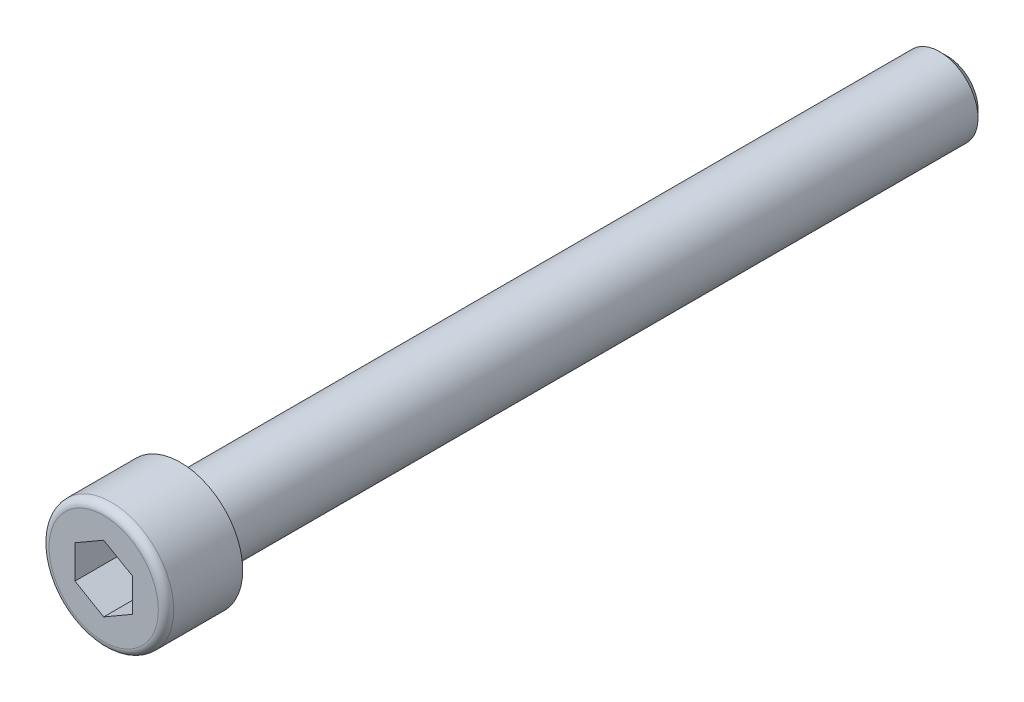
ISO-10303-21;
HEADER;
FILE_DESCRIPTION(('STEP AP214'),'2;1');
FILE_NAME('part.step','',(''),(''),'','','');
FILE_SCHEMA(('AUTOMOTIVE_DESIGN { 1 0 10303 214 1 1 1 1 }'));
ENDSEC;
DATA;
#1=APPLICATION_CONTEXT('core data for automotive mechanical design processes');
#2=APPLICATION_PROTOCOL_DEFINITION('international standard','automotive_design',2000,#1);
#3=PRODUCT_CONTEXT('',#1,'mechanical');
#4=PRODUCT('Part','Part','',(#3));
#5=PRODUCT_RELATED_PRODUCT_CATEGORY('part','',(#4));
#6=PRODUCT_DEFINITION_FORMATION('','',#4);
#7=PRODUCT_DEFINITION_CONTEXT('part definition',#1,'design');
#8=PRODUCT_DEFINITION('design','',#6,#7);
#9=PRODUCT_DEFINITION_SHAPE('','',#8);
#10=(LENGTH_UNIT() NAMED_UNIT(*) SI_UNIT(.MILLI.,.METRE.));
#11=(NAMED_UNIT(*) PLANE_ANGLE_UNIT() SI_UNIT($,.RADIAN.));
#12=(NAMED_UNIT(*) SI_UNIT($,.STERADIAN.) SOLID_ANGLE_UNIT());
#13=UNCERTAINTY_MEASURE_WITH_UNIT(LENGTH_MEASURE(1.E-05),#10,'distance_accuracy_value','');
#14=(GEOMETRIC_REPRESENTATION_CONTEXT(3) GLOBAL_UNCERTAINTY_ASSIGNED_CONTEXT((#13)) GLOBAL_UNIT_ASSIGNED_CONTEXT((#10,
#11,#12)) REPRESENTATION_CONTEXT('',''));
#15=CARTESIAN_POINT('',(0.,0.,0.));
#16=DIRECTION('',(0.,0.,1.));
#17=DIRECTION('',(1.,0.,0.));
#18=AXIS2_PLACEMENT_3D('',#15,#16,#17);
#19=CARTESIAN_POINT('',(3.20000000000001,0.,-80.));
#20=DIRECTION('',(0.,0.,-1.));
#21=DIRECTION('',(-1.,0.,0.));
#22=AXIS2_PLACEMENT_3D('',#19,#20,#21);
#23=PLANE('',#22);
#24=CARTESIAN_POINT('',(0.,0.,-80.));
#25=DIRECTION('',(0.,0.,1.));
#26=DIRECTION('',(1.,0.,0.));
#27=AXIS2_PLACEMENT_3D('',#24,#25,#26);
#28=CIRCLE('',#27,3.20000000000001);
#29=CARTESIAN_POINT('',(3.20000000000001,0.,-80.));
#30=VERTEX_POINT('',#29);
#31=EDGE_CURVE('E141',#30,#30,#28,.T.);
#32=ORIENTED_EDGE('',*,*,#31,.F.);
#33=EDGE_LOOP('',(#32));
#34=FACE_BOUND('',#33,.T.);
#35=ADVANCED_FACE('F40',(#34),#23,.T.);
#36=CARTESIAN_POINT('',(0.,0.,8.));
#37=DIRECTION('',(0.,0.,1.));
#38=DIRECTION('',(1.,0.,0.));
#39=AXIS2_PLACEMENT_3D('',#36,#37,#38);
#40=PLANE('',#39);
#41=DIRECTION('',(0.866025403784439,0.5,0.));
#42=VECTOR('',#41,1.);
#43=CARTESIAN_POINT('',(0.,-3.46410161513776,8.));
#44=LINE('',#43,#42);
#45=CARTESIAN_POINT('',(0.,-3.46410161513776,8.));
#46=VERTEX_POINT('',#45);
#47=CARTESIAN_POINT('',(3.,-1.73205080756888,8.));
#48=VERTEX_POINT('',#47);
#49=EDGE_CURVE('E54',#46,#48,#44,.T.);
#50=ORIENTED_EDGE('',*,*,#49,.F.);
#51=DIRECTION('',(0.866025403784438,-0.5,0.));
#52=VECTOR('',#51,1.);
#53=CARTESIAN_POINT('',(-3.,-1.73205080756888,8.));
#54=LINE('',#53,#52);
#55=CARTESIAN_POINT('',(-3.,-1.73205080756888,8.));
#56=VERTEX_POINT('',#55);
#57=EDGE_CURVE('E137',#56,#46,#54,.T.);
#58=ORIENTED_EDGE('',*,*,#57,.F.);
#59=DIRECTION('',(0.,-1.,0.));
#60=VECTOR('',#59,1.);
#61=CARTESIAN_POINT('',(-3.,1.73205080756888,8.));
#62=LINE('',#61,#60);
#63=CARTESIAN_POINT('',(-3.,1.73205080756888,8.));
#64=VERTEX_POINT('',#63);
#65=EDGE_CURVE('E135',#64,#56,#62,.T.);
#66=ORIENTED_EDGE('',*,*,#65,.F.);
#67=DIRECTION('',(-0.866025403784439,-0.5,0.));
#68=VECTOR('',#67,1.);
#69=CARTESIAN_POINT('',(0.,3.46410161513776,8.));
#70=LINE('',#69,#68);
#71=CARTESIAN_POINT('',(0.,3.46410161513776,8.));
#72=VERTEX_POINT('',#71);
#73=EDGE_CURVE('E102',#72,#64,#70,.T.);
#74=ORIENTED_EDGE('',*,*,#73,.F.);
#75=DIRECTION('',(-0.866025403784439,0.5,0.));
#76=VECTOR('',#75,1.);
#77=CARTESIAN_POINT('',(3.,1.73205080756888,8.));
#78=LINE('',#77,#76);
#79=CARTESIAN_POINT('',(3.,1.73205080756888,8.));
#80=VERTEX_POINT('',#79);
#81=EDGE_CURVE('E131',#80,#72,#78,.T.);
#82=ORIENTED_EDGE('',*,*,#81,.F.);
#83=DIRECTION('',(0.,1.,0.));
#84=VECTOR('',#83,1.);
#85=CARTESIAN_POINT('',(3.,-1.73205080756888,8.));
#86=LINE('',#85,#84);
#87=EDGE_CURVE('E128',#48,#80,#86,.T.);
#88=ORIENTED_EDGE('',*,*,#87,.F.);
#89=EDGE_LOOP('',(#50,#58,#66,#74,#82,#88));
#90=FACE_BOUND('',#89,.T.);
#91=CARTESIAN_POINT('',(0.,0.,8.));
#92=DIRECTION('',(0.,0.,1.));
#93=DIRECTION('',(1.,0.,0.));
#94=AXIS2_PLACEMENT_3D('',#91,#92,#93);
#95=CIRCLE('',#94,5.7);
#96=CARTESIAN_POINT('',(5.7,0.,8.));
#97=VERTEX_POINT('',#96);
#98=EDGE_CURVE('E11',#97,#97,#95,.T.);
#99=ORIENTED_EDGE('',*,*,#98,.T.);
#100=EDGE_LOOP('',(#99));
#101=FACE_BOUND('',#100,.T.);
#102=ADVANCED_FACE('F175',(#90,#101),#40,.T.);
#103=CARTESIAN_POINT('',(0.,0.,7.2));
#104=DIRECTION('',(0.,0.,1.));
#105=DIRECTION('',(1.,0.,0.));
#106=AXIS2_PLACEMENT_3D('',#103,#104,#105);
#107=TOROIDAL_SURFACE('',#106,5.7,0.8);
#108=CARTESIAN_POINT('',(0.,0.,7.2));
#109=DIRECTION('',(0.,0.,1.));
#110=DIRECTION('',(1.,0.,0.));
#111=AXIS2_PLACEMENT_3D('',#108,#109,#110);
#112=CIRCLE('',#111,6.5);
#113=CARTESIAN_POINT('',(6.5,0.,7.2));
#114=VERTEX_POINT('',#113);
#115=EDGE_CURVE('E47',#114,#114,#112,.T.);
#116=ORIENTED_EDGE('',*,*,#115,.T.);
#117=EDGE_LOOP('',(#116));
#118=FACE_BOUND('',#117,.T.);
#119=ORIENTED_EDGE('',*,*,#98,.F.);
#120=EDGE_LOOP('',(#119));
#121=FACE_BOUND('',#120,.T.);
#122=ADVANCED_FACE('F160',(#118,#121),#107,.T.);
#123=CARTESIAN_POINT('',(0.,0.,-20.5554846650529));
#124=DIRECTION('',(0.,0.,1.));
#125=DIRECTION('',(1.,0.,0.));
#126=AXIS2_PLACEMENT_3D('',#123,#124,#125);
#127=CYLINDRICAL_SURFACE('',#126,6.5);
#128=CARTESIAN_POINT('',(0.,0.,0.));
#129=DIRECTION('',(0.,0.,1.));
#130=DIRECTION('',(1.,0.,0.));
#131=AXIS2_PLACEMENT_3D('',#128,#129,#130);
#132=CIRCLE('',#131,6.5);
#133=CARTESIAN_POINT('',(6.5,0.,0.));
#134=VERTEX_POINT('',#133);
#135=EDGE_CURVE('E155',#134,#134,#132,.T.);
#136=ORIENTED_EDGE('',*,*,#135,.T.);
#137=EDGE_LOOP('',(#136));
#138=FACE_BOUND('',#137,.T.);
#139=ORIENTED_EDGE('',*,*,#115,.F.);
#140=EDGE_LOOP('',(#139));
#141=FACE_BOUND('',#140,.T.);
#142=ADVANCED_FACE('F163',(#138,#141),#127,.T.);
#143=CARTESIAN_POINT('',(6.5,0.,0.));
#144=DIRECTION('',(0.,0.,-1.));
#145=DIRECTION('',(-1.,0.,0.));
#146=AXIS2_PLACEMENT_3D('',#143,#144,#145);
#147=PLANE('',#146);
#148=CARTESIAN_POINT('',(0.,0.,0.));
#149=DIRECTION('',(0.,0.,1.));
#150=DIRECTION('',(1.,0.,0.));
#151=AXIS2_PLACEMENT_3D('',#148,#149,#150);
#152=CIRCLE('',#151,4.00000000000002);
#153=CARTESIAN_POINT('',(4.00000000000002,0.,0.));
#154=VERTEX_POINT('',#153);
#155=EDGE_CURVE('E152',#154,#154,#152,.T.);
#156=ORIENTED_EDGE('',*,*,#155,.T.);
#157=EDGE_LOOP('',(#156));
#158=FACE_BOUND('',#157,.T.);
#159=ORIENTED_EDGE('',*,*,#135,.F.);
#160=EDGE_LOOP('',(#159));
#161=FACE_BOUND('',#160,.T.);
#162=ADVANCED_FACE('F165',(#158,#161),#147,.T.);
#163=CARTESIAN_POINT('',(0.,0.,-20.5554846650529));
#164=DIRECTION('',(0.,0.,1.));
#165=DIRECTION('',(1.,0.,0.));
#166=AXIS2_PLACEMENT_3D('',#163,#164,#165);
#167=CYLINDRICAL_SURFACE('',#166,4.00000000000001);
#168=CARTESIAN_POINT('',(0.,0.,-79.2));
#169=DIRECTION('',(0.,0.,1.));
#170=DIRECTION('',(1.,0.,0.));
#171=AXIS2_PLACEMENT_3D('',#168,#169,#170);
#172=CIRCLE('',#171,4.00000000000001);
#173=CARTESIAN_POINT('',(4.00000000000001,0.,-79.2));
#174=VERTEX_POINT('',#173);
#175=EDGE_CURVE('E149',#174,#174,#172,.T.);
#176=ORIENTED_EDGE('',*,*,#175,.T.);
#177=EDGE_LOOP('',(#176));
#178=FACE_BOUND('',#177,.T.);
#179=ORIENTED_EDGE('',*,*,#155,.F.);
#180=EDGE_LOOP('',(#179));
#181=FACE_BOUND('',#180,.T.);
#182=ADVANCED_FACE('F172',(#178,#181),#167,.T.);
#183=CARTESIAN_POINT('',(0.,0.,-79.2));
#184=DIRECTION('',(0.,0.,1.));
#185=DIRECTION('',(1.,0.,0.));
#186=AXIS2_PLACEMENT_3D('',#183,#184,#185);
#187=CONICAL_SURFACE('',#186,4.00000000000001,0.785398163397451);
#188=ORIENTED_EDGE('',*,*,#31,.T.);
#189=EDGE_LOOP('',(#188));
#190=FACE_BOUND('',#189,.T.);
#191=ORIENTED_EDGE('',*,*,#175,.F.);
#192=EDGE_LOOP('',(#191));
#193=FACE_BOUND('',#192,.T.);
#194=ADVANCED_FACE('F185',(#190,#193),#187,.T.);
#195=CARTESIAN_POINT('',(0.,-3.46410161513776,2.));
#196=DIRECTION('',(0.5,-0.866025403784439,0.));
#197=DIRECTION('',(0.866025403784439,0.5,0.));
#198=AXIS2_PLACEMENT_3D('',#195,#196,#197);
#199=PLANE('',#198);
#200=ORIENTED_EDGE('',*,*,#49,.T.);
#201=DIRECTION('',(0.,0.,1.));
#202=VECTOR('',#201,1.);
#203=CARTESIAN_POINT('',(3.,-1.73205080756888,2.));
#204=LINE('',#203,#202);
#205=CARTESIAN_POINT('',(3.,-1.73205080756888,2.));
#206=VERTEX_POINT('',#205);
#207=EDGE_CURVE('E84',#206,#48,#204,.T.);
#208=ORIENTED_EDGE('',*,*,#207,.F.);
#209=DIRECTION('',(0.866025403784439,0.5,0.));
#210=VECTOR('',#209,1.);
#211=CARTESIAN_POINT('',(0.,-3.46410161513776,2.));
#212=LINE('',#211,#210);
#213=CARTESIAN_POINT('',(0.,-3.46410161513776,2.));
#214=VERTEX_POINT('',#213);
#215=EDGE_CURVE('E139',#214,#206,#212,.T.);
#216=ORIENTED_EDGE('',*,*,#215,.F.);
#217=DIRECTION('',(0.,0.,1.));
#218=VECTOR('',#217,1.);
#219=CARTESIAN_POINT('',(0.,-3.46410161513776,2.));
#220=LINE('',#219,#218);
#221=EDGE_CURVE('E62',#214,#46,#220,.T.);
#222=ORIENTED_EDGE('',*,*,#221,.T.);
#223=EDGE_LOOP('',(#200,#208,#216,#222));
#224=FACE_BOUND('',#223,.T.);
#225=ADVANCED_FACE('F188',(#224),#199,.F.);
#226=CARTESIAN_POINT('',(-3.,-1.73205080756888,2.));
#227=DIRECTION('',(-0.500000000000001,-0.866025403784438,0.));
#228=DIRECTION('',(0.866025403784438,-0.500000000000001,0.));
#229=AXIS2_PLACEMENT_3D('',#226,#227,#228);
#230=PLANE('',#229);
#231=ORIENTED_EDGE('',*,*,#57,.T.);
#232=ORIENTED_EDGE('',*,*,#221,.F.);
#233=DIRECTION('',(0.866025403784438,-0.5,0.));
#234=VECTOR('',#233,1.);
#235=CARTESIAN_POINT('',(-3.,-1.73205080756888,2.));
#236=LINE('',#235,#234);
#237=CARTESIAN_POINT('',(-3.,-1.73205080756888,2.));
#238=VERTEX_POINT('',#237);
#239=EDGE_CURVE('E114',#238,#214,#236,.T.);
#240=ORIENTED_EDGE('',*,*,#239,.F.);
#241=DIRECTION('',(0.,0.,1.));
#242=VECTOR('',#241,1.);
#243=CARTESIAN_POINT('',(-3.,-1.73205080756888,2.));
#244=LINE('',#243,#242);
#245=EDGE_CURVE('E106',#238,#56,#244,.T.);
#246=ORIENTED_EDGE('',*,*,#245,.T.);
#247=EDGE_LOOP('',(#231,#232,#240,#246));
#248=FACE_BOUND('',#247,.T.);
#249=ADVANCED_FACE('F203',(#248),#230,.F.);
#250=CARTESIAN_POINT('',(-3.,1.73205080756888,2.));
#251=DIRECTION('',(-1.,0.,0.));
#252=DIRECTION('',(0.,0.,1.));
#253=AXIS2_PLACEMENT_3D('',#250,#251,#252);
#254=PLANE('',#253);
#255=ORIENTED_EDGE('',*,*,#65,.T.);
#256=ORIENTED_EDGE('',*,*,#245,.F.);
#257=DIRECTION('',(0.,-1.,0.));
#258=VECTOR('',#257,1.);
#259=CARTESIAN_POINT('',(-3.,1.73205080756888,2.));
#260=LINE('',#259,#258);
#261=CARTESIAN_POINT('',(-3.,1.73205080756888,2.));
#262=VERTEX_POINT('',#261);
#263=EDGE_CURVE('E110',#262,#238,#260,.T.);
#264=ORIENTED_EDGE('',*,*,#263,.F.);
#265=DIRECTION('',(0.,0.,1.));
#266=VECTOR('',#265,1.);
#267=CARTESIAN_POINT('',(-3.,1.73205080756888,2.));
#268=LINE('',#267,#266);
#269=EDGE_CURVE('E95',#262,#64,#268,.T.);
#270=ORIENTED_EDGE('',*,*,#269,.T.);
#271=EDGE_LOOP('',(#255,#256,#264,#270));
#272=FACE_BOUND('',#271,.T.);
#273=ADVANCED_FACE('F111',(#272),#254,.F.);
#274=CARTESIAN_POINT('',(0.,3.46410161513776,2.));
#275=DIRECTION('',(-0.5,0.866025403784439,0.));
#276=DIRECTION('',(-0.866025403784439,-0.5,0.));
#277=AXIS2_PLACEMENT_3D('',#274,#275,#276);
#278=PLANE('',#277);
#279=ORIENTED_EDGE('',*,*,#73,.T.);
#280=ORIENTED_EDGE('',*,*,#269,.F.);
#281=DIRECTION('',(-0.866025403784439,-0.5,0.));
#282=VECTOR('',#281,1.);
#283=CARTESIAN_POINT('',(0.,3.46410161513776,2.));
#284=LINE('',#283,#282);
#285=CARTESIAN_POINT('',(0.,3.46410161513776,2.));
#286=VERTEX_POINT('',#285);
#287=EDGE_CURVE('E99',#286,#262,#284,.T.);
#288=ORIENTED_EDGE('',*,*,#287,.F.);
#289=DIRECTION('',(0.,0.,1.));
#290=VECTOR('',#289,1.);
#291=CARTESIAN_POINT('',(0.,3.46410161513776,2.));
#292=LINE('',#291,#290);
#293=EDGE_CURVE('E107',#286,#72,#292,.T.);
#294=ORIENTED_EDGE('',*,*,#293,.T.);
#295=EDGE_LOOP('',(#279,#280,#288,#294));
#296=FACE_BOUND('',#295,.T.);
#297=ADVANCED_FACE('F97',(#296),#278,.F.);
#298=CARTESIAN_POINT('',(3.,1.73205080756888,2.));
#299=DIRECTION('',(0.5,0.866025403784439,0.));
#300=DIRECTION('',(-0.866025403784439,0.5,0.));
#301=AXIS2_PLACEMENT_3D('',#298,#299,#300);
#302=PLANE('',#301);
#303=ORIENTED_EDGE('',*,*,#81,.T.);
#304=ORIENTED_EDGE('',*,*,#293,.F.);
#305=DIRECTION('',(-0.866025403784439,0.5,0.));
#306=VECTOR('',#305,1.);
#307=CARTESIAN_POINT('',(3.,1.73205080756888,2.));
#308=LINE('',#307,#306);
#309=CARTESIAN_POINT('',(3.,1.73205080756888,2.));
#310=VERTEX_POINT('',#309);
#311=EDGE_CURVE('E120',#310,#286,#308,.T.);
#312=ORIENTED_EDGE('',*,*,#311,.F.);
#313=DIRECTION('',(0.,0.,1.));
#314=VECTOR('',#313,1.);
#315=CARTESIAN_POINT('',(3.,1.73205080756888,2.));
#316=LINE('',#315,#314);
#317=EDGE_CURVE('E144',#310,#80,#316,.T.);
#318=ORIENTED_EDGE('',*,*,#317,.T.);
#319=EDGE_LOOP('',(#303,#304,#312,#318));
#320=FACE_BOUND('',#319,.T.);
#321=ADVANCED_FACE('F207',(#320),#302,.F.);
#322=CARTESIAN_POINT('',(3.,-1.73205080756888,2.));
#323=DIRECTION('',(1.,0.,0.));
#324=DIRECTION('',(0.,1.,0.));
#325=AXIS2_PLACEMENT_3D('',#322,#323,#324);
#326=PLANE('',#325);
#327=ORIENTED_EDGE('',*,*,#87,.T.);
#328=ORIENTED_EDGE('',*,*,#317,.F.);
#329=DIRECTION('',(0.,1.,0.));
#330=VECTOR('',#329,1.);
#331=CARTESIAN_POINT('',(3.,-1.73205080756888,2.));
#332=LINE('',#331,#330);
#333=EDGE_CURVE('E122',#206,#310,#332,.T.);
#334=ORIENTED_EDGE('',*,*,#333,.F.);
#335=ORIENTED_EDGE('',*,*,#207,.T.);
#336=EDGE_LOOP('',(#327,#328,#334,#335));
#337=FACE_BOUND('',#336,.T.);
#338=ADVANCED_FACE('F204',(#337),#326,.F.);
#339=CARTESIAN_POINT('',(3.,-1.73205080756888,2.));
#340=DIRECTION('',(0.,0.,1.));
#341=DIRECTION('',(1.,0.,0.));
#342=AXIS2_PLACEMENT_3D('',#339,#340,#341);
#343=PLANE('',#342);
#344=ORIENTED_EDGE('',*,*,#215,.T.);
#345=ORIENTED_EDGE('',*,*,#333,.T.);
#346=ORIENTED_EDGE('',*,*,#311,.T.);
#347=ORIENTED_EDGE('',*,*,#287,.T.);
#348=ORIENTED_EDGE('',*,*,#263,.T.);
#349=ORIENTED_EDGE('',*,*,#239,.T.);
#350=EDGE_LOOP('',(#344,#345,#346,#347,#348,#349));
#351=FACE_BOUND('',#350,.T.);
#352=ADVANCED_FACE('F117',(#351),#343,.T.);
#353=CLOSED_SHELL('',(#35,#102,#122,#142,#162,#182,#194,#225,#249,#273,#297,#321,#338,#352));
#354=MANIFOLD_SOLID_BREP('B2',#353);
#355=ADVANCED_BREP_SHAPE_REPRESENTATION('',(#18,#354),#14);
#356=SHAPE_DEFINITION_REPRESENTATION(#9,#355);
ENDSEC;
END-ISO-10303-21;
